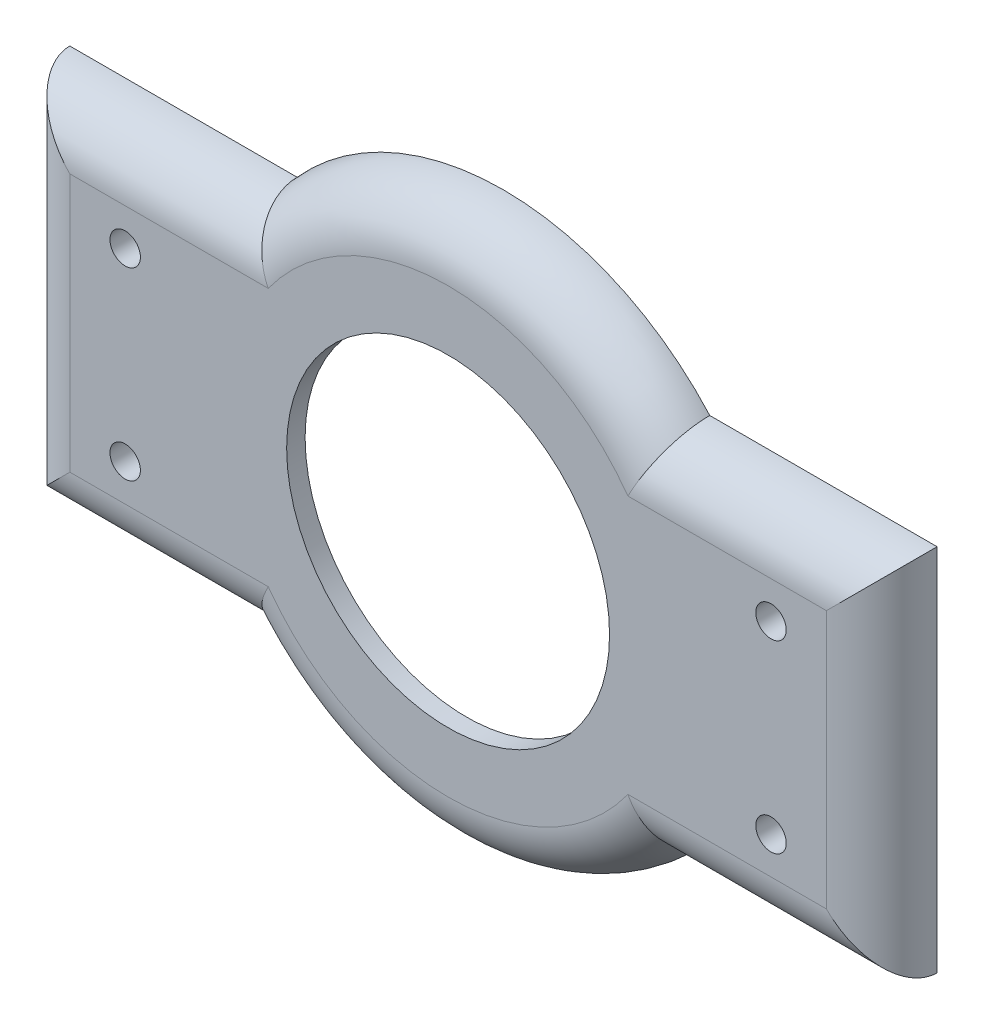
ISO-10303-21;
HEADER;
FILE_DESCRIPTION(('STEP AP214'),'2;1');
FILE_NAME('part.step','',(''),(''),'','','');
FILE_SCHEMA(('AUTOMOTIVE_DESIGN { 1 0 10303 214 1 1 1 1 }'));
ENDSEC;
DATA;
#1=APPLICATION_CONTEXT('core data for automotive mechanical design processes');
#2=APPLICATION_PROTOCOL_DEFINITION('international standard','automotive_design',2000,#1);
#3=PRODUCT_CONTEXT('',#1,'mechanical');
#4=PRODUCT('Part','Part','',(#3));
#5=PRODUCT_RELATED_PRODUCT_CATEGORY('part','',(#4));
#6=PRODUCT_DEFINITION_FORMATION('','',#4);
#7=PRODUCT_DEFINITION_CONTEXT('part definition',#1,'design');
#8=PRODUCT_DEFINITION('design','',#6,#7);
#9=PRODUCT_DEFINITION_SHAPE('','',#8);
#10=(LENGTH_UNIT() NAMED_UNIT(*) SI_UNIT(.MILLI.,.METRE.));
#11=(NAMED_UNIT(*) PLANE_ANGLE_UNIT() SI_UNIT($,.RADIAN.));
#12=(NAMED_UNIT(*) SI_UNIT($,.STERADIAN.) SOLID_ANGLE_UNIT());
#13=UNCERTAINTY_MEASURE_WITH_UNIT(LENGTH_MEASURE(1.E-05),#10,'distance_accuracy_value','');
#14=(GEOMETRIC_REPRESENTATION_CONTEXT(3) GLOBAL_UNCERTAINTY_ASSIGNED_CONTEXT((#13)) GLOBAL_UNIT_ASSIGNED_CONTEXT((#10,
#11,#12)) REPRESENTATION_CONTEXT('',''));
#15=CARTESIAN_POINT('',(0.,0.,0.));
#16=DIRECTION('',(0.,0.,1.));
#17=DIRECTION('',(1.,0.,0.));
#18=AXIS2_PLACEMENT_3D('',#15,#16,#17);
#19=CARTESIAN_POINT('',(0.,0.,2.));
#20=DIRECTION('',(0.,0.,1.));
#21=DIRECTION('',(1.,0.,0.));
#22=AXIS2_PLACEMENT_3D('',#19,#20,#21);
#23=PLANE('',#22);
#24=CARTESIAN_POINT('',(-35.,10.,2.));
#25=DIRECTION('',(0.,0.,1.));
#26=DIRECTION('',(1.,0.,0.));
#27=AXIS2_PLACEMENT_3D('',#24,#25,#26);
#28=CIRCLE('',#27,1.64999999999998);
#29=CARTESIAN_POINT('',(-33.35,10.,2.));
#30=VERTEX_POINT('',#29);
#31=EDGE_CURVE('E260',#30,#30,#28,.T.);
#32=ORIENTED_EDGE('',*,*,#31,.F.);
#33=EDGE_LOOP('',(#32));
#34=FACE_BOUND('',#33,.T.);
#35=CARTESIAN_POINT('',(-35.,-10.,2.));
#36=DIRECTION('',(0.,0.,1.));
#37=DIRECTION('',(1.,0.,0.));
#38=AXIS2_PLACEMENT_3D('',#35,#36,#37);
#39=CIRCLE('',#38,1.64999999999998);
#40=CARTESIAN_POINT('',(-33.35,-10.,2.));
#41=VERTEX_POINT('',#40);
#42=EDGE_CURVE('E265',#41,#41,#39,.T.);
#43=ORIENTED_EDGE('',*,*,#42,.F.);
#44=EDGE_LOOP('',(#43));
#45=FACE_BOUND('',#44,.T.);
#46=CARTESIAN_POINT('',(35.,10.,2.));
#47=DIRECTION('',(0.,0.,1.));
#48=DIRECTION('',(1.,0.,0.));
#49=AXIS2_PLACEMENT_3D('',#46,#47,#48);
#50=CIRCLE('',#49,1.64999999999998);
#51=CARTESIAN_POINT('',(36.65,10.,2.));
#52=VERTEX_POINT('',#51);
#53=EDGE_CURVE('E274',#52,#52,#50,.T.);
#54=ORIENTED_EDGE('',*,*,#53,.F.);
#55=EDGE_LOOP('',(#54));
#56=FACE_BOUND('',#55,.T.);
#57=CARTESIAN_POINT('',(35.,-10.,2.));
#58=DIRECTION('',(0.,0.,1.));
#59=DIRECTION('',(1.,0.,0.));
#60=AXIS2_PLACEMENT_3D('',#57,#58,#59);
#61=CIRCLE('',#60,1.64999999999998);
#62=CARTESIAN_POINT('',(36.65,-10.,2.));
#63=VERTEX_POINT('',#62);
#64=EDGE_CURVE('E282',#63,#63,#61,.T.);
#65=ORIENTED_EDGE('',*,*,#64,.F.);
#66=EDGE_LOOP('',(#65));
#67=FACE_BOUND('',#66,.T.);
#68=DIRECTION('',(-1.,0.,0.));
#69=VECTOR('',#68,1.);
#70=CARTESIAN_POINT('',(0.,-14.,2.));
#71=LINE('',#70,#69);
#72=CARTESIAN_POINT('',(19.4935886896179,-14.,2.));
#73=VERTEX_POINT('',#72);
#74=CARTESIAN_POINT('',(41.,-14.,2.));
#75=VERTEX_POINT('',#74);
#76=EDGE_CURVE('E59',#73,#75,#71,.F.);
#77=ORIENTED_EDGE('',*,*,#76,.T.);
#78=DIRECTION('',(0.,-1.,0.));
#79=VECTOR('',#78,1.);
#80=CARTESIAN_POINT('',(41.,0.,2.));
#81=LINE('',#80,#79);
#82=CARTESIAN_POINT('',(41.,14.,2.));
#83=VERTEX_POINT('',#82);
#84=EDGE_CURVE('E11',#75,#83,#81,.F.);
#85=ORIENTED_EDGE('',*,*,#84,.T.);
#86=DIRECTION('',(1.,0.,0.));
#87=VECTOR('',#86,1.);
#88=CARTESIAN_POINT('',(0.,14.,2.));
#89=LINE('',#88,#87);
#90=CARTESIAN_POINT('',(19.4935886896179,14.,2.));
#91=VERTEX_POINT('',#90);
#92=EDGE_CURVE('E328',#83,#91,#89,.F.);
#93=ORIENTED_EDGE('',*,*,#92,.T.);
#94=CARTESIAN_POINT('',(0.,0.,2.));
#95=DIRECTION('',(0.,0.,1.));
#96=DIRECTION('',(1.,0.,0.));
#97=AXIS2_PLACEMENT_3D('',#94,#95,#96);
#98=CIRCLE('',#97,24.);
#99=CARTESIAN_POINT('',(-19.4935886896179,14.,2.));
#100=VERTEX_POINT('',#99);
#101=EDGE_CURVE('E325',#91,#100,#98,.T.);
#102=ORIENTED_EDGE('',*,*,#101,.T.);
#103=DIRECTION('',(1.,0.,0.));
#104=VECTOR('',#103,1.);
#105=CARTESIAN_POINT('',(0.,14.,2.));
#106=LINE('',#105,#104);
#107=CARTESIAN_POINT('',(-41.,14.,2.));
#108=VERTEX_POINT('',#107);
#109=EDGE_CURVE('E315',#100,#108,#106,.F.);
#110=ORIENTED_EDGE('',*,*,#109,.T.);
#111=DIRECTION('',(0.,1.,0.));
#112=VECTOR('',#111,1.);
#113=CARTESIAN_POINT('',(-41.,0.,2.));
#114=LINE('',#113,#112);
#115=CARTESIAN_POINT('',(-41.,-14.,2.));
#116=VERTEX_POINT('',#115);
#117=EDGE_CURVE('E318',#108,#116,#114,.F.);
#118=ORIENTED_EDGE('',*,*,#117,.T.);
#119=DIRECTION('',(-1.,0.,0.));
#120=VECTOR('',#119,1.);
#121=CARTESIAN_POINT('',(0.,-14.,2.));
#122=LINE('',#121,#120);
#123=CARTESIAN_POINT('',(-19.4935886896179,-14.,2.));
#124=VERTEX_POINT('',#123);
#125=EDGE_CURVE('E157',#116,#124,#122,.F.);
#126=ORIENTED_EDGE('',*,*,#125,.T.);
#127=CARTESIAN_POINT('',(0.,0.,2.));
#128=DIRECTION('',(0.,0.,1.));
#129=DIRECTION('',(1.,0.,0.));
#130=AXIS2_PLACEMENT_3D('',#127,#128,#129);
#131=CIRCLE('',#130,24.);
#132=EDGE_CURVE('E322',#124,#73,#131,.T.);
#133=ORIENTED_EDGE('',*,*,#132,.T.);
#134=EDGE_LOOP('',(#77,#85,#93,#102,#110,#118,#126,#133));
#135=FACE_BOUND('',#134,.T.);
#136=CARTESIAN_POINT('',(0.,0.,2.00000000000003));
#137=DIRECTION('',(0.,0.,-1.));
#138=DIRECTION('',(-1.,0.,0.));
#139=AXIS2_PLACEMENT_3D('',#136,#137,#138);
#140=CIRCLE('',#139,17.5);
#141=CARTESIAN_POINT('',(-17.5,0.,2.00000000000003));
#142=VERTEX_POINT('',#141);
#143=EDGE_CURVE('E154',#142,#142,#140,.T.);
#144=ORIENTED_EDGE('',*,*,#143,.T.);
#145=EDGE_LOOP('',(#144));
#146=FACE_BOUND('',#145,.T.);
#147=ADVANCED_FACE('F49',(#34,#45,#56,#67,#135,#146),#23,.T.);
#148=CARTESIAN_POINT('',(0.,0.,-4.));
#149=DIRECTION('',(0.,0.,-1.));
#150=DIRECTION('',(-1.,0.,0.));
#151=AXIS2_PLACEMENT_3D('',#148,#149,#150);
#152=PLANE('',#151);
#153=CARTESIAN_POINT('',(-35.,10.,-4.));
#154=DIRECTION('',(0.,0.,-1.));
#155=DIRECTION('',(-1.,0.,0.));
#156=AXIS2_PLACEMENT_3D('',#153,#154,#155);
#157=CIRCLE('',#156,1.64999999999999);
#158=CARTESIAN_POINT('',(-36.65,10.,-4.));
#159=VERTEX_POINT('',#158);
#160=EDGE_CURVE('E257',#159,#159,#157,.T.);
#161=ORIENTED_EDGE('',*,*,#160,.F.);
#162=EDGE_LOOP('',(#161));
#163=FACE_BOUND('',#162,.T.);
#164=CARTESIAN_POINT('',(-35.,-10.,-4.));
#165=DIRECTION('',(0.,0.,-1.));
#166=DIRECTION('',(-1.,0.,0.));
#167=AXIS2_PLACEMENT_3D('',#164,#165,#166);
#168=CIRCLE('',#167,1.64999999999999);
#169=CARTESIAN_POINT('',(-36.65,-10.,-4.));
#170=VERTEX_POINT('',#169);
#171=EDGE_CURVE('E270',#170,#170,#168,.T.);
#172=ORIENTED_EDGE('',*,*,#171,.F.);
#173=EDGE_LOOP('',(#172));
#174=FACE_BOUND('',#173,.T.);
#175=CARTESIAN_POINT('',(35.,10.,-4.));
#176=DIRECTION('',(0.,0.,-1.));
#177=DIRECTION('',(-1.,0.,0.));
#178=AXIS2_PLACEMENT_3D('',#175,#176,#177);
#179=CIRCLE('',#178,1.64999999999999);
#180=CARTESIAN_POINT('',(33.35,10.,-4.));
#181=VERTEX_POINT('',#180);
#182=EDGE_CURVE('E278',#181,#181,#179,.T.);
#183=ORIENTED_EDGE('',*,*,#182,.F.);
#184=EDGE_LOOP('',(#183));
#185=FACE_BOUND('',#184,.T.);
#186=CARTESIAN_POINT('',(35.,-10.,-4.));
#187=DIRECTION('',(0.,0.,-1.));
#188=DIRECTION('',(-1.,0.,0.));
#189=AXIS2_PLACEMENT_3D('',#186,#187,#188);
#190=CIRCLE('',#189,1.64999999999999);
#191=CARTESIAN_POINT('',(33.35,-10.,-4.));
#192=VERTEX_POINT('',#191);
#193=EDGE_CURVE('E286',#192,#192,#190,.T.);
#194=ORIENTED_EDGE('',*,*,#193,.F.);
#195=EDGE_LOOP('',(#194));
#196=FACE_BOUND('',#195,.T.);
#197=CARTESIAN_POINT('',(0.,0.,-4.));
#198=DIRECTION('',(0.,0.,-1.));
#199=DIRECTION('',(-1.,0.,0.));
#200=AXIS2_PLACEMENT_3D('',#197,#198,#199);
#201=CIRCLE('',#200,25.);
#202=CARTESIAN_POINT('',(-25.,0.,-4.));
#203=VERTEX_POINT('',#202);
#204=EDGE_CURVE('E305',#203,#203,#201,.T.);
#205=ORIENTED_EDGE('',*,*,#204,.F.);
#206=EDGE_LOOP('',(#205));
#207=FACE_BOUND('',#206,.T.);
#208=CARTESIAN_POINT('',(0.,0.,-4.));
#209=DIRECTION('',(0.,0.,-1.));
#210=DIRECTION('',(-1.,0.,0.));
#211=AXIS2_PLACEMENT_3D('',#208,#209,#210);
#212=CIRCLE('',#211,30.);
#213=CARTESIAN_POINT('',(-22.3606797749979,20.,-4.));
#214=VERTEX_POINT('',#213);
#215=CARTESIAN_POINT('',(22.3606797749979,20.,-4.));
#216=VERTEX_POINT('',#215);
#217=EDGE_CURVE('E312',#214,#216,#212,.T.);
#218=ORIENTED_EDGE('',*,*,#217,.T.);
#219=DIRECTION('',(1.,0.,0.));
#220=VECTOR('',#219,1.);
#221=CARTESIAN_POINT('',(47.,20.,-4.));
#222=LINE('',#221,#220);
#223=CARTESIAN_POINT('',(47.,20.,-4.));
#224=VERTEX_POINT('',#223);
#225=EDGE_CURVE('E153',#216,#224,#222,.T.);
#226=ORIENTED_EDGE('',*,*,#225,.T.);
#227=DIRECTION('',(0.,-1.,0.));
#228=VECTOR('',#227,1.);
#229=CARTESIAN_POINT('',(47.,-20.,-4.));
#230=LINE('',#229,#228);
#231=CARTESIAN_POINT('',(47.,-20.,-4.));
#232=VERTEX_POINT('',#231);
#233=EDGE_CURVE('E143',#224,#232,#230,.T.);
#234=ORIENTED_EDGE('',*,*,#233,.T.);
#235=DIRECTION('',(-1.,0.,0.));
#236=VECTOR('',#235,1.);
#237=CARTESIAN_POINT('',(47.,-20.,-4.));
#238=LINE('',#237,#236);
#239=CARTESIAN_POINT('',(22.3606797749979,-20.,-4.));
#240=VERTEX_POINT('',#239);
#241=EDGE_CURVE('E142',#232,#240,#238,.T.);
#242=ORIENTED_EDGE('',*,*,#241,.T.);
#243=CARTESIAN_POINT('',(-22.3606797749979,-20.,-4.));
#244=VERTEX_POINT('',#243);
#245=EDGE_CURVE('E136',#240,#244,#212,.T.);
#246=ORIENTED_EDGE('',*,*,#245,.T.);
#247=CARTESIAN_POINT('',(-47.,-20.,-4.));
#248=VERTEX_POINT('',#247);
#249=EDGE_CURVE('E130',#244,#248,#238,.T.);
#250=ORIENTED_EDGE('',*,*,#249,.T.);
#251=DIRECTION('',(0.,1.,0.));
#252=VECTOR('',#251,1.);
#253=CARTESIAN_POINT('',(-47.,-20.,-4.));
#254=LINE('',#253,#252);
#255=CARTESIAN_POINT('',(-47.,20.,-4.));
#256=VERTEX_POINT('',#255);
#257=EDGE_CURVE('E133',#248,#256,#254,.T.);
#258=ORIENTED_EDGE('',*,*,#257,.T.);
#259=EDGE_CURVE('E302',#256,#214,#222,.T.);
#260=ORIENTED_EDGE('',*,*,#259,.T.);
#261=EDGE_LOOP('',(#218,#226,#234,#242,#246,#250,#258,#260));
#262=FACE_BOUND('',#261,.T.);
#263=ADVANCED_FACE('F132',(#163,#174,#185,#196,#207,#262),#152,.T.);
#264=CARTESIAN_POINT('',(0.,0.,-4.));
#265=DIRECTION('',(0.,0.,1.));
#266=DIRECTION('',(1.,0.,0.));
#267=AXIS2_PLACEMENT_3D('',#264,#265,#266);
#268=CYLINDRICAL_SURFACE('',#267,25.);
#269=ORIENTED_EDGE('',*,*,#204,.T.);
#270=EDGE_LOOP('',(#269));
#271=FACE_BOUND('',#270,.T.);
#272=CARTESIAN_POINT('',(0.,0.,0.));
#273=DIRECTION('',(0.,0.,-1.));
#274=DIRECTION('',(-1.,0.,0.));
#275=AXIS2_PLACEMENT_3D('',#272,#273,#274);
#276=CIRCLE('',#275,25.);
#277=CARTESIAN_POINT('',(-25.,0.,0.));
#278=VERTEX_POINT('',#277);
#279=EDGE_CURVE('E298',#278,#278,#276,.T.);
#280=ORIENTED_EDGE('',*,*,#279,.F.);
#281=EDGE_LOOP('',(#280));
#282=FACE_BOUND('',#281,.T.);
#283=ADVANCED_FACE('F224',(#271,#282),#268,.F.);
#284=CARTESIAN_POINT('',(0.,0.,0.));
#285=DIRECTION('',(0.,0.,1.));
#286=DIRECTION('',(1.,0.,0.));
#287=AXIS2_PLACEMENT_3D('',#284,#285,#286);
#288=PLANE('',#287);
#289=CARTESIAN_POINT('',(0.,0.,0.));
#290=DIRECTION('',(0.,0.,-1.));
#291=DIRECTION('',(-1.,0.,0.));
#292=AXIS2_PLACEMENT_3D('',#289,#290,#291);
#293=CIRCLE('',#292,17.5);
#294=CARTESIAN_POINT('',(-17.5,0.,0.));
#295=VERTEX_POINT('',#294);
#296=EDGE_CURVE('E163',#295,#295,#293,.T.);
#297=ORIENTED_EDGE('',*,*,#296,.F.);
#298=EDGE_LOOP('',(#297));
#299=FACE_BOUND('',#298,.T.);
#300=ORIENTED_EDGE('',*,*,#279,.T.);
#301=EDGE_LOOP('',(#300));
#302=FACE_BOUND('',#301,.T.);
#303=ADVANCED_FACE('F220',(#299,#302),#288,.F.);
#304=CARTESIAN_POINT('',(0.,0.,2.00000000000003));
#305=DIRECTION('',(0.,0.,-1.));
#306=DIRECTION('',(-1.,0.,0.));
#307=AXIS2_PLACEMENT_3D('',#304,#305,#306);
#308=CYLINDRICAL_SURFACE('',#307,17.5);
#309=ORIENTED_EDGE('',*,*,#143,.F.);
#310=EDGE_LOOP('',(#309));
#311=FACE_BOUND('',#310,.T.);
#312=ORIENTED_EDGE('',*,*,#296,.T.);
#313=EDGE_LOOP('',(#312));
#314=FACE_BOUND('',#313,.T.);
#315=ADVANCED_FACE('F223',(#311,#314),#308,.F.);
#316=CARTESIAN_POINT('',(-41.,-20.,-4.));
#317=DIRECTION('',(0.,1.,0.));
#318=DIRECTION('',(0.,0.,1.));
#319=AXIS2_PLACEMENT_3D('',#316,#317,#318);
#320=CYLINDRICAL_SURFACE('',#319,6.);
#321=CARTESIAN_POINT('',(-41.,-14.,-4.));
#322=DIRECTION('',(-0.707106781186547,0.707106781186547,0.));
#323=DIRECTION('',(0.707106781186547,0.707106781186547,0.));
#324=AXIS2_PLACEMENT_3D('',#321,#322,#323);
#325=ELLIPSE('',#324,8.48528137423857,6.);
#326=EDGE_CURVE('E148',#116,#248,#325,.F.);
#327=ORIENTED_EDGE('',*,*,#326,.F.);
#328=ORIENTED_EDGE('',*,*,#117,.F.);
#329=CARTESIAN_POINT('',(-41.,14.,-4.));
#330=DIRECTION('',(0.707106781186547,0.707106781186547,0.));
#331=DIRECTION('',(0.707106781186547,-0.707106781186547,0.));
#332=AXIS2_PLACEMENT_3D('',#329,#330,#331);
#333=ELLIPSE('',#332,8.48528137423857,6.);
#334=EDGE_CURVE('E53',#256,#108,#333,.T.);
#335=ORIENTED_EDGE('',*,*,#334,.F.);
#336=ORIENTED_EDGE('',*,*,#257,.F.);
#337=EDGE_LOOP('',(#327,#328,#335,#336));
#338=FACE_BOUND('',#337,.T.);
#339=ADVANCED_FACE('F51',(#338),#320,.T.);
#340=CARTESIAN_POINT('',(47.,14.,-4.));
#341=DIRECTION('',(1.,0.,0.));
#342=DIRECTION('',(0.,0.,-1.));
#343=AXIS2_PLACEMENT_3D('',#340,#341,#342);
#344=CYLINDRICAL_SURFACE('',#343,6.);
#345=ORIENTED_EDGE('',*,*,#334,.T.);
#346=ORIENTED_EDGE('',*,*,#109,.F.);
#347=CARTESIAN_POINT('',(-22.3606797749979,20.,-4.));
#348=CARTESIAN_POINT('',(-22.3606885946868,20.0000246248411,-3.8421552052644));
#349=CARTESIAN_POINT('',(-22.3578946208042,19.9937723539707,-3.68431782060247));
#350=CARTESIAN_POINT('',(-22.3467659816735,19.9688946352079,-3.36984998464221));
#351=CARTESIAN_POINT('',(-22.3384324794666,19.9502717845575,-3.21321928697762));
#352=CARTESIAN_POINT('',(-22.3163215306498,19.9009046069552,-2.9027376627166));
#353=CARTESIAN_POINT('',(-22.3025598394186,19.8701953614595,-2.74888002690595));
#354=CARTESIAN_POINT('',(-22.2697136666972,19.7969937760329,-2.44457447554402));
#355=CARTESIAN_POINT('',(-22.2506290856713,19.7545012157596,-2.29412662381104));
#356=CARTESIAN_POINT('',(-22.2073087006702,19.6582045895661,-1.9977544183201));
#357=CARTESIAN_POINT('',(-22.183075687498,19.6044066521063,-1.85182766272716));
#358=CARTESIAN_POINT('',(-22.1296387585979,19.4860098874083,-1.56530631435557));
#359=CARTESIAN_POINT('',(-22.100432998967,19.4214070538535,-1.42471372322721));
#360=CARTESIAN_POINT('',(-22.0372832655125,19.2820428722381,-1.14977619202819));
#361=CARTESIAN_POINT('',(-22.0033394004845,19.2072817574316,-1.01543110859761));
#362=CARTESIAN_POINT('',(-21.9309502480705,19.0482634156329,-0.753694698315457));
#363=CARTESIAN_POINT('',(-21.8925032521829,18.9640025848766,-0.626306037803511));
#364=CARTESIAN_POINT('',(-21.81006943435,18.783868860479,-0.375192277558907));
#365=CARTESIAN_POINT('',(-21.7659437439989,18.6877087181069,-0.251718583062626));
#366=CARTESIAN_POINT('',(-21.6734924399382,18.4869066812776,-0.0135265858213059));
#367=CARTESIAN_POINT('',(-21.6251653105735,18.3822617268776,0.101188529030902));
#368=CARTESIAN_POINT('',(-21.4743637011181,18.0569107969631,0.431340688345207));
#369=CARTESIAN_POINT('',(-21.3660097099654,17.8246587141122,0.632964134834508));
#370=CARTESIAN_POINT('',(-21.1269204948331,17.3165670418239,1.01087006931773));
#371=CARTESIAN_POINT('',(-20.9950785299177,17.0387148777664,1.18371822278674));
#372=CARTESIAN_POINT('',(-20.719257115299,16.4634300807909,1.48053987909019));
#373=CARTESIAN_POINT('',(-20.5752695448377,16.1659843768813,1.60448036194777));
#374=CARTESIAN_POINT('',(-20.2793743453335,15.5615637855901,1.80189453622453));
#375=CARTESIAN_POINT('',(-20.1275296590345,15.2546707934992,1.87571761250212));
#376=CARTESIAN_POINT('',(-19.8180438644189,14.6365503036601,1.97431545107953));
#377=CARTESIAN_POINT('',(-19.660415129243,14.3253328528119,1.99918933026693));
#378=CARTESIAN_POINT('',(-19.498818843525,14.0101964652727,1.99999351599242));
#379=CARTESIAN_POINT('',(-19.4962039457782,14.0050980649796,2.00000001397718));
#380=CARTESIAN_POINT('',(-19.4935886896179,14.,2.));
#381=B_SPLINE_CURVE_WITH_KNOTS('',3,(#347,#348,#349,#350,#351,#352,#353,#354,#355,#356,#357,
#358,#359,#360,#361,#362,#363,#364,#365,#366,#367,#368,#369,#370,#371,#372,#373,#374,#375,#376,
#377,#378,#379,#380),.UNSPECIFIED.,.F.,.F.,(4,2,2,2,2,2,2,2,2,2,2,2,2,2,2,2,4),(0.,
0.473374539403875,0.946649723740478,1.41856121222911,1.89048152583675,2.36214667602337,
2.83398710288178,3.30581669719329,3.77782588851301,4.26508767936846,4.75252598352504,
5.72672161906379,6.78081230257462,7.83561344195162,8.88298355645046,9.92823066732191,
9.94542026148344),.UNSPECIFIED.);
#382=EDGE_CURVE('E159',#214,#100,#381,.T.);
#383=ORIENTED_EDGE('',*,*,#382,.F.);
#384=ORIENTED_EDGE('',*,*,#259,.F.);
#385=EDGE_LOOP('',(#345,#346,#383,#384));
#386=FACE_BOUND('',#385,.T.);
#387=ADVANCED_FACE('F181',(#386),#344,.T.);
#388=CARTESIAN_POINT('',(47.,-14.,-4.));
#389=DIRECTION('',(-1.,0.,0.));
#390=DIRECTION('',(0.,0.,1.));
#391=AXIS2_PLACEMENT_3D('',#388,#389,#390);
#392=CYLINDRICAL_SURFACE('',#391,6.);
#393=ORIENTED_EDGE('',*,*,#326,.T.);
#394=ORIENTED_EDGE('',*,*,#249,.F.);
#395=CARTESIAN_POINT('',(-22.3606797749979,-20.,-4.));
#396=CARTESIAN_POINT('',(-22.3606885946868,-20.0000246248411,-3.8421552052644));
#397=CARTESIAN_POINT('',(-22.3578946208042,-19.9937723539707,-3.68431782060247));
#398=CARTESIAN_POINT('',(-22.3467659816735,-19.9688946352079,-3.36984998464221));
#399=CARTESIAN_POINT('',(-22.3384324794666,-19.9502717845575,-3.21321928697762));
#400=CARTESIAN_POINT('',(-22.3163215306498,-19.9009046069552,-2.9027376627166));
#401=CARTESIAN_POINT('',(-22.3025598394186,-19.8701953614595,-2.74888002690594));
#402=CARTESIAN_POINT('',(-22.2697136666972,-19.7969937760329,-2.44457447554402));
#403=CARTESIAN_POINT('',(-22.2506290856713,-19.7545012157596,-2.29412662381104));
#404=CARTESIAN_POINT('',(-22.2073087006702,-19.6582045895661,-1.9977544183201));
#405=CARTESIAN_POINT('',(-22.183075687498,-19.6044066521063,-1.85182766272716));
#406=CARTESIAN_POINT('',(-22.1296387585979,-19.4860098874083,-1.56530631435557));
#407=CARTESIAN_POINT('',(-22.100432998967,-19.4214070538535,-1.42471372322721));
#408=CARTESIAN_POINT('',(-22.0372832655125,-19.2820428722381,-1.14977619202819));
#409=CARTESIAN_POINT('',(-22.0033394004845,-19.2072817574316,-1.01543110859761));
#410=CARTESIAN_POINT('',(-21.9309502480705,-19.0482634156329,-0.753694698315458));
#411=CARTESIAN_POINT('',(-21.8925032521829,-18.9640025848766,-0.626306037803511));
#412=CARTESIAN_POINT('',(-21.81006943435,-18.783868860479,-0.375192277558906));
#413=CARTESIAN_POINT('',(-21.7659437439989,-18.6877087181069,-0.251718583062626));
#414=CARTESIAN_POINT('',(-21.6734924399382,-18.4869066812776,-0.0135265858213052));
#415=CARTESIAN_POINT('',(-21.6251653105735,-18.3822617268776,0.101188529030902));
#416=CARTESIAN_POINT('',(-21.4743637011181,-18.0569107969631,0.431340688345207));
#417=CARTESIAN_POINT('',(-21.3660097099654,-17.8246587141122,0.632964134834509));
#418=CARTESIAN_POINT('',(-21.1269204948331,-17.3165670418239,1.01087006931773));
#419=CARTESIAN_POINT('',(-20.9950785299177,-17.0387148777664,1.18371822278674));
#420=CARTESIAN_POINT('',(-20.7192571152989,-16.4634300807909,1.48053987909019));
#421=CARTESIAN_POINT('',(-20.5752695448377,-16.1659843768813,1.60448036194777));
#422=CARTESIAN_POINT('',(-20.2793743453335,-15.5615637855901,1.80189453622453));
#423=CARTESIAN_POINT('',(-20.1275296590345,-15.2546707934992,1.87571761250212));
#424=CARTESIAN_POINT('',(-19.8180438644189,-14.6365503036602,1.97431545107953));
#425=CARTESIAN_POINT('',(-19.6604151292429,-14.325332852812,1.99918933026693));
#426=CARTESIAN_POINT('',(-19.498818843525,-14.0101964652727,1.99999351599242));
#427=CARTESIAN_POINT('',(-19.4962039457782,-14.0050980649796,2.00000001397718));
#428=CARTESIAN_POINT('',(-19.4935886896179,-14.,2.));
#429=B_SPLINE_CURVE_WITH_KNOTS('',3,(#395,#396,#397,#398,#399,#400,#401,#402,#403,#404,#405,
#406,#407,#408,#409,#410,#411,#412,#413,#414,#415,#416,#417,#418,#419,#420,#421,#422,#423,#424,
#425,#426,#427,#428),.UNSPECIFIED.,.F.,.F.,(4,2,2,2,2,2,2,2,2,2,2,2,2,2,2,2,4),(0.,
0.473374539403875,0.946649723740479,1.41856121222912,1.89048152583675,2.36214667602337,
2.83398710288178,3.30581669719328,3.77782588851301,4.26508767936846,4.75252598352504,
5.72672161906379,6.78081230257463,7.83561344195162,8.88298355645046,9.92823066732191,
9.94542026148344),.UNSPECIFIED.);
#430=EDGE_CURVE('E166',#124,#244,#429,.F.);
#431=ORIENTED_EDGE('',*,*,#430,.F.);
#432=ORIENTED_EDGE('',*,*,#125,.F.);
#433=EDGE_LOOP('',(#393,#394,#431,#432));
#434=FACE_BOUND('',#433,.T.);
#435=ADVANCED_FACE('F156',(#434),#392,.T.);
#436=CARTESIAN_POINT('',(0.,0.,-4.));
#437=DIRECTION('',(0.,0.,1.));
#438=DIRECTION('',(1.,0.,0.));
#439=AXIS2_PLACEMENT_3D('',#436,#437,#438);
#440=TOROIDAL_SURFACE('',#439,24.,6.);
#441=ORIENTED_EDGE('',*,*,#382,.T.);
#442=ORIENTED_EDGE('',*,*,#101,.F.);
#443=CARTESIAN_POINT('',(22.3606797749979,20.,-4.));
#444=CARTESIAN_POINT('',(22.3606885946868,20.0000246248411,-3.8421552052644));
#445=CARTESIAN_POINT('',(22.3578946208042,19.9937723539707,-3.68431782060247));
#446=CARTESIAN_POINT('',(22.3467659816735,19.9688946352079,-3.36984998464221));
#447=CARTESIAN_POINT('',(22.3384324794666,19.9502717845575,-3.21321928697762));
#448=CARTESIAN_POINT('',(22.3163215306498,19.9009046069552,-2.9027376627166));
#449=CARTESIAN_POINT('',(22.3025598394186,19.8701953614595,-2.74888002690594));
#450=CARTESIAN_POINT('',(22.2697136666972,19.7969937760329,-2.44457447554402));
#451=CARTESIAN_POINT('',(22.2506290856713,19.7545012157596,-2.29412662381104));
#452=CARTESIAN_POINT('',(22.2073087006702,19.6582045895661,-1.9977544183201));
#453=CARTESIAN_POINT('',(22.183075687498,19.6044066521063,-1.85182766272716));
#454=CARTESIAN_POINT('',(22.1296387585979,19.4860098874083,-1.56530631435557));
#455=CARTESIAN_POINT('',(22.100432998967,19.4214070538535,-1.42471372322721));
#456=CARTESIAN_POINT('',(22.0372832655125,19.2820428722381,-1.14977619202819));
#457=CARTESIAN_POINT('',(22.0033394004845,19.2072817574316,-1.01543110859761));
#458=CARTESIAN_POINT('',(21.9309502480705,19.0482634156329,-0.753694698315458));
#459=CARTESIAN_POINT('',(21.8925032521829,18.9640025848766,-0.626306037803511));
#460=CARTESIAN_POINT('',(21.81006943435,18.783868860479,-0.375192277558906));
#461=CARTESIAN_POINT('',(21.7659437439989,18.6877087181069,-0.251718583062626));
#462=CARTESIAN_POINT('',(21.6734924399382,18.4869066812776,-0.0135265858213052));
#463=CARTESIAN_POINT('',(21.6251653105735,18.3822617268776,0.101188529030902));
#464=CARTESIAN_POINT('',(21.4743637011181,18.0569107969631,0.431340688345207));
#465=CARTESIAN_POINT('',(21.3660097099654,17.8246587141122,0.632964134834509));
#466=CARTESIAN_POINT('',(21.1269204948331,17.3165670418239,1.01087006931773));
#467=CARTESIAN_POINT('',(20.9950785299177,17.0387148777664,1.18371822278674));
#468=CARTESIAN_POINT('',(20.7192571152989,16.4634300807909,1.48053987909019));
#469=CARTESIAN_POINT('',(20.5752695448377,16.1659843768813,1.60448036194777));
#470=CARTESIAN_POINT('',(20.2793743453335,15.5615637855901,1.80189453622453));
#471=CARTESIAN_POINT('',(20.1275296590345,15.2546707934992,1.87571761250212));
#472=CARTESIAN_POINT('',(19.8180438644189,14.6365503036602,1.97431545107953));
#473=CARTESIAN_POINT('',(19.6604151292429,14.325332852812,1.99918933026693));
#474=CARTESIAN_POINT('',(19.498818843525,14.0101964652727,1.99999351599242));
#475=CARTESIAN_POINT('',(19.4962039457782,14.0050980649796,2.00000001397718));
#476=CARTESIAN_POINT('',(19.4935886896179,14.,2.));
#477=B_SPLINE_CURVE_WITH_KNOTS('',3,(#443,#444,#445,#446,#447,#448,#449,#450,#451,#452,#453,
#454,#455,#456,#457,#458,#459,#460,#461,#462,#463,#464,#465,#466,#467,#468,#469,#470,#471,#472,
#473,#474,#475,#476),.UNSPECIFIED.,.F.,.F.,(4,2,2,2,2,2,2,2,2,2,2,2,2,2,2,2,4),(0.,
0.473374539403875,0.946649723740479,1.41856121222912,1.89048152583675,2.36214667602337,
2.83398710288178,3.30581669719328,3.77782588851301,4.26508767936846,4.75252598352504,
5.72672161906379,6.78081230257463,7.83561344195162,8.88298355645046,9.92823066732191,
9.94542026148344),.UNSPECIFIED.);
#478=EDGE_CURVE('E194',#216,#91,#477,.T.);
#479=ORIENTED_EDGE('',*,*,#478,.F.);
#480=ORIENTED_EDGE('',*,*,#217,.F.);
#481=EDGE_LOOP('',(#441,#442,#479,#480));
#482=FACE_BOUND('',#481,.T.);
#483=ADVANCED_FACE('F183',(#482),#440,.T.);
#484=CARTESIAN_POINT('',(0.,0.,-4.));
#485=DIRECTION('',(0.,0.,1.));
#486=DIRECTION('',(1.,0.,0.));
#487=AXIS2_PLACEMENT_3D('',#484,#485,#486);
#488=TOROIDAL_SURFACE('',#487,24.,6.);
#489=ORIENTED_EDGE('',*,*,#430,.T.);
#490=ORIENTED_EDGE('',*,*,#245,.F.);
#491=CARTESIAN_POINT('',(22.3606797749979,-20.,-4.));
#492=CARTESIAN_POINT('',(22.3606885946868,-20.0000246248411,-3.8421552052644));
#493=CARTESIAN_POINT('',(22.3578946208042,-19.9937723539707,-3.68431782060247));
#494=CARTESIAN_POINT('',(22.3467659816735,-19.9688946352079,-3.36984998464221));
#495=CARTESIAN_POINT('',(22.3384324794666,-19.9502717845575,-3.21321928697762));
#496=CARTESIAN_POINT('',(22.3163215306498,-19.9009046069552,-2.9027376627166));
#497=CARTESIAN_POINT('',(22.3025598394186,-19.8701953614595,-2.74888002690594));
#498=CARTESIAN_POINT('',(22.2697136666972,-19.7969937760329,-2.44457447554402));
#499=CARTESIAN_POINT('',(22.2506290856713,-19.7545012157596,-2.29412662381104));
#500=CARTESIAN_POINT('',(22.2073087006702,-19.6582045895661,-1.9977544183201));
#501=CARTESIAN_POINT('',(22.183075687498,-19.6044066521063,-1.85182766272716));
#502=CARTESIAN_POINT('',(22.1296387585979,-19.4860098874083,-1.56530631435557));
#503=CARTESIAN_POINT('',(22.100432998967,-19.4214070538535,-1.42471372322721));
#504=CARTESIAN_POINT('',(22.0372832655125,-19.2820428722381,-1.14977619202819));
#505=CARTESIAN_POINT('',(22.0033394004845,-19.2072817574316,-1.01543110859761));
#506=CARTESIAN_POINT('',(21.9309502480705,-19.0482634156329,-0.753694698315458));
#507=CARTESIAN_POINT('',(21.8925032521829,-18.9640025848766,-0.626306037803511));
#508=CARTESIAN_POINT('',(21.81006943435,-18.783868860479,-0.375192277558906));
#509=CARTESIAN_POINT('',(21.7659437439989,-18.6877087181069,-0.251718583062626));
#510=CARTESIAN_POINT('',(21.6734924399382,-18.4869066812776,-0.0135265858213052));
#511=CARTESIAN_POINT('',(21.6251653105735,-18.3822617268776,0.101188529030902));
#512=CARTESIAN_POINT('',(21.4743637011181,-18.0569107969631,0.431340688345207));
#513=CARTESIAN_POINT('',(21.3660097099654,-17.8246587141122,0.632964134834509));
#514=CARTESIAN_POINT('',(21.1269204948331,-17.3165670418239,1.01087006931773));
#515=CARTESIAN_POINT('',(20.9950785299177,-17.0387148777664,1.18371822278674));
#516=CARTESIAN_POINT('',(20.7192571152989,-16.4634300807909,1.48053987909019));
#517=CARTESIAN_POINT('',(20.5752695448377,-16.1659843768813,1.60448036194777));
#518=CARTESIAN_POINT('',(20.2793743453335,-15.5615637855901,1.80189453622453));
#519=CARTESIAN_POINT('',(20.1275296590345,-15.2546707934992,1.87571761250212));
#520=CARTESIAN_POINT('',(19.8180438644189,-14.6365503036602,1.97431545107953));
#521=CARTESIAN_POINT('',(19.6604151292429,-14.325332852812,1.99918933026693));
#522=CARTESIAN_POINT('',(19.498818843525,-14.0101964652727,1.99999351599242));
#523=CARTESIAN_POINT('',(19.4962039457782,-14.0050980649796,2.00000001397718));
#524=CARTESIAN_POINT('',(19.4935886896179,-14.,2.));
#525=B_SPLINE_CURVE_WITH_KNOTS('',3,(#491,#492,#493,#494,#495,#496,#497,#498,#499,#500,#501,
#502,#503,#504,#505,#506,#507,#508,#509,#510,#511,#512,#513,#514,#515,#516,#517,#518,#519,#520,
#521,#522,#523,#524),.UNSPECIFIED.,.F.,.F.,(4,2,2,2,2,2,2,2,2,2,2,2,2,2,2,2,4),(0.,
0.473374539403875,0.946649723740479,1.41856121222912,1.89048152583675,2.36214667602337,
2.83398710288178,3.30581669719328,3.77782588851301,4.26508767936846,4.75252598352504,
5.72672161906379,6.78081230257463,7.83561344195162,8.88298355645046,9.92823066732191,
9.94542026148344),.UNSPECIFIED.);
#526=EDGE_CURVE('E202',#73,#240,#525,.F.);
#527=ORIENTED_EDGE('',*,*,#526,.F.);
#528=ORIENTED_EDGE('',*,*,#132,.F.);
#529=EDGE_LOOP('',(#489,#490,#527,#528));
#530=FACE_BOUND('',#529,.T.);
#531=ADVANCED_FACE('F187',(#530),#488,.T.);
#532=CARTESIAN_POINT('',(47.,14.,-4.));
#533=DIRECTION('',(1.,0.,0.));
#534=DIRECTION('',(0.,0.,-1.));
#535=AXIS2_PLACEMENT_3D('',#532,#533,#534);
#536=CYLINDRICAL_SURFACE('',#535,6.);
#537=ORIENTED_EDGE('',*,*,#478,.T.);
#538=ORIENTED_EDGE('',*,*,#92,.F.);
#539=CARTESIAN_POINT('',(41.,14.,-4.));
#540=DIRECTION('',(0.707106781186547,-0.707106781186547,0.));
#541=DIRECTION('',(0.707106781186547,0.707106781186547,0.));
#542=AXIS2_PLACEMENT_3D('',#539,#540,#541);
#543=ELLIPSE('',#542,8.48528137423857,6.);
#544=EDGE_CURVE('E75',#224,#83,#543,.T.);
#545=ORIENTED_EDGE('',*,*,#544,.F.);
#546=ORIENTED_EDGE('',*,*,#225,.F.);
#547=EDGE_LOOP('',(#537,#538,#545,#546));
#548=FACE_BOUND('',#547,.T.);
#549=ADVANCED_FACE('F191',(#548),#536,.T.);
#550=CARTESIAN_POINT('',(47.,-14.,-4.));
#551=DIRECTION('',(-1.,0.,0.));
#552=DIRECTION('',(0.,0.,1.));
#553=AXIS2_PLACEMENT_3D('',#550,#551,#552);
#554=CYLINDRICAL_SURFACE('',#553,6.);
#555=ORIENTED_EDGE('',*,*,#526,.T.);
#556=ORIENTED_EDGE('',*,*,#241,.F.);
#557=CARTESIAN_POINT('',(41.,-14.,-4.));
#558=DIRECTION('',(-0.707106781186547,-0.707106781186547,0.));
#559=DIRECTION('',(-0.707106781186547,0.707106781186547,0.));
#560=AXIS2_PLACEMENT_3D('',#557,#558,#559);
#561=ELLIPSE('',#560,8.48528137423857,6.);
#562=EDGE_CURVE('E290',#75,#232,#561,.F.);
#563=ORIENTED_EDGE('',*,*,#562,.F.);
#564=ORIENTED_EDGE('',*,*,#76,.F.);
#565=EDGE_LOOP('',(#555,#556,#563,#564));
#566=FACE_BOUND('',#565,.T.);
#567=ADVANCED_FACE('F211',(#566),#554,.T.);
#568=CARTESIAN_POINT('',(41.,-20.,-4.));
#569=DIRECTION('',(0.,-1.,0.));
#570=DIRECTION('',(0.,0.,-1.));
#571=AXIS2_PLACEMENT_3D('',#568,#569,#570);
#572=CYLINDRICAL_SURFACE('',#571,6.);
#573=ORIENTED_EDGE('',*,*,#544,.T.);
#574=ORIENTED_EDGE('',*,*,#84,.F.);
#575=ORIENTED_EDGE('',*,*,#562,.T.);
#576=ORIENTED_EDGE('',*,*,#233,.F.);
#577=EDGE_LOOP('',(#573,#574,#575,#576));
#578=FACE_BOUND('',#577,.T.);
#579=ADVANCED_FACE('F215',(#578),#572,.T.);
#580=CARTESIAN_POINT('',(35.,-10.,2.));
#581=DIRECTION('',(0.,0.,1.));
#582=DIRECTION('',(1.,0.,0.));
#583=AXIS2_PLACEMENT_3D('',#580,#581,#582);
#584=CYLINDRICAL_SURFACE('',#583,1.64999999999999);
#585=ORIENTED_EDGE('',*,*,#193,.T.);
#586=EDGE_LOOP('',(#585));
#587=FACE_BOUND('',#586,.T.);
#588=ORIENTED_EDGE('',*,*,#64,.T.);
#589=EDGE_LOOP('',(#588));
#590=FACE_BOUND('',#589,.T.);
#591=ADVANCED_FACE('F219',(#587,#590),#584,.F.);
#592=CARTESIAN_POINT('',(35.,10.,2.));
#593=DIRECTION('',(0.,0.,1.));
#594=DIRECTION('',(1.,0.,0.));
#595=AXIS2_PLACEMENT_3D('',#592,#593,#594);
#596=CYLINDRICAL_SURFACE('',#595,1.64999999999999);
#597=ORIENTED_EDGE('',*,*,#182,.T.);
#598=EDGE_LOOP('',(#597));
#599=FACE_BOUND('',#598,.T.);
#600=ORIENTED_EDGE('',*,*,#53,.T.);
#601=EDGE_LOOP('',(#600));
#602=FACE_BOUND('',#601,.T.);
#603=ADVANCED_FACE('F240',(#599,#602),#596,.F.);
#604=CARTESIAN_POINT('',(-35.,-10.,2.));
#605=DIRECTION('',(0.,0.,1.));
#606=DIRECTION('',(1.,0.,0.));
#607=AXIS2_PLACEMENT_3D('',#604,#605,#606);
#608=CYLINDRICAL_SURFACE('',#607,1.64999999999999);
#609=ORIENTED_EDGE('',*,*,#171,.T.);
#610=EDGE_LOOP('',(#609));
#611=FACE_BOUND('',#610,.T.);
#612=ORIENTED_EDGE('',*,*,#42,.T.);
#613=EDGE_LOOP('',(#612));
#614=FACE_BOUND('',#613,.T.);
#615=ADVANCED_FACE('F244',(#611,#614),#608,.F.);
#616=CARTESIAN_POINT('',(-35.,10.,2.));
#617=DIRECTION('',(0.,0.,1.));
#618=DIRECTION('',(1.,0.,0.));
#619=AXIS2_PLACEMENT_3D('',#616,#617,#618);
#620=CYLINDRICAL_SURFACE('',#619,1.64999999999999);
#621=ORIENTED_EDGE('',*,*,#160,.T.);
#622=EDGE_LOOP('',(#621));
#623=FACE_BOUND('',#622,.T.);
#624=ORIENTED_EDGE('',*,*,#31,.T.);
#625=EDGE_LOOP('',(#624));
#626=FACE_BOUND('',#625,.T.);
#627=ADVANCED_FACE('F248',(#623,#626),#620,.F.);
#628=CLOSED_SHELL('',(#147,#263,#283,#303,#315,#339,#387,#435,#483,#531,#549,#567,#579,#591,
#603,#615,#627));
#629=MANIFOLD_SOLID_BREP('B2',#628);
#630=ADVANCED_BREP_SHAPE_REPRESENTATION('',(#18,#629),#14);
#631=SHAPE_DEFINITION_REPRESENTATION(#9,#630);
ENDSEC;
END-ISO-10303-21;
